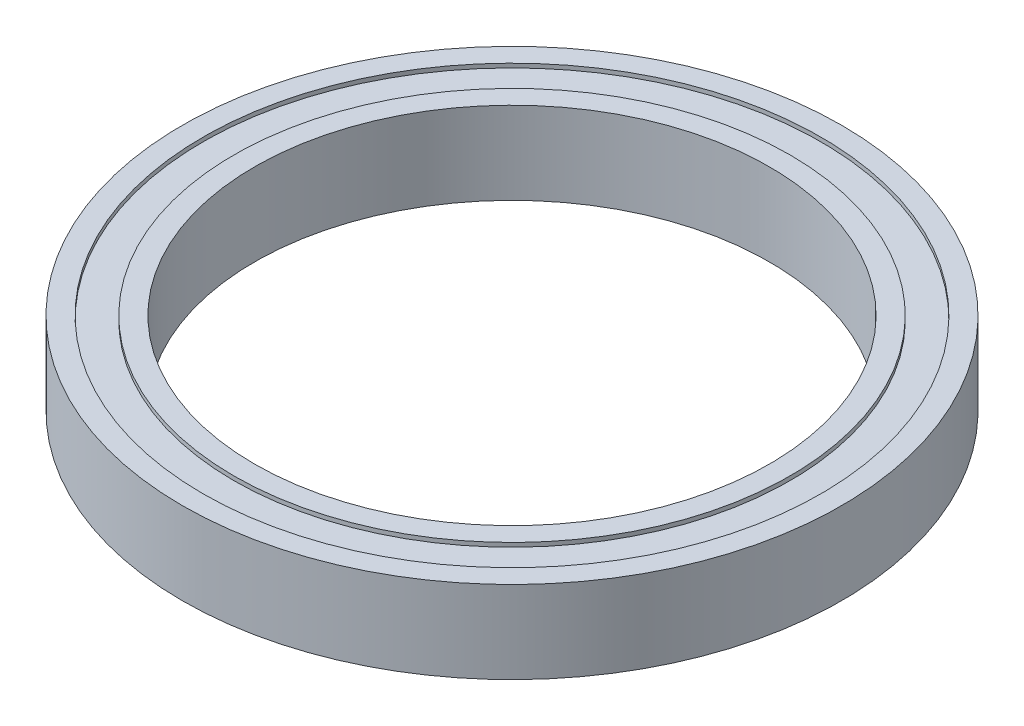
ISO-10303-21;
HEADER;
FILE_DESCRIPTION(('STEP AP214'),'2;1');
FILE_NAME('part.step','',(''),(''),'','','');
FILE_SCHEMA(('AUTOMOTIVE_DESIGN { 1 0 10303 214 1 1 1 1 }'));
ENDSEC;
DATA;
#1=APPLICATION_CONTEXT('core data for automotive mechanical design processes');
#2=APPLICATION_PROTOCOL_DEFINITION('international standard','automotive_design',2000,#1);
#3=PRODUCT_CONTEXT('',#1,'mechanical');
#4=PRODUCT('Part','Part','',(#3));
#5=PRODUCT_RELATED_PRODUCT_CATEGORY('part','',(#4));
#6=PRODUCT_DEFINITION_FORMATION('','',#4);
#7=PRODUCT_DEFINITION_CONTEXT('part definition',#1,'design');
#8=PRODUCT_DEFINITION('design','',#6,#7);
#9=PRODUCT_DEFINITION_SHAPE('','',#8);
#10=(LENGTH_UNIT() NAMED_UNIT(*) SI_UNIT(.MILLI.,.METRE.));
#11=(NAMED_UNIT(*) PLANE_ANGLE_UNIT() SI_UNIT($,.RADIAN.));
#12=(NAMED_UNIT(*) SI_UNIT($,.STERADIAN.) SOLID_ANGLE_UNIT());
#13=UNCERTAINTY_MEASURE_WITH_UNIT(LENGTH_MEASURE(1.E-05),#10,'distance_accuracy_value','');
#14=(GEOMETRIC_REPRESENTATION_CONTEXT(3) GLOBAL_UNCERTAINTY_ASSIGNED_CONTEXT((#13)) GLOBAL_UNIT_ASSIGNED_CONTEXT((#10,
#11,#12)) REPRESENTATION_CONTEXT('',''));
#15=CARTESIAN_POINT('',(0.,0.,0.));
#16=DIRECTION('',(0.,0.,1.));
#17=DIRECTION('',(1.,0.,0.));
#18=AXIS2_PLACEMENT_3D('',#15,#16,#17);
#19=CARTESIAN_POINT('',(0.,0.,0.));
#20=DIRECTION('',(0.,1.,0.));
#21=DIRECTION('',(0.,0.,1.));
#22=AXIS2_PLACEMENT_3D('',#19,#20,#21);
#23=PLANE('',#22);
#24=CARTESIAN_POINT('',(0.,0.,0.));
#25=DIRECTION('',(0.,1.,0.));
#26=DIRECTION('',(0.,0.,1.));
#27=AXIS2_PLACEMENT_3D('',#24,#25,#26);
#28=CIRCLE('',#27,12.5);
#29=CARTESIAN_POINT('',(0.,0.,12.5));
#30=VERTEX_POINT('',#29);
#31=EDGE_CURVE('E48',#30,#30,#28,.T.);
#32=ORIENTED_EDGE('',*,*,#31,.T.);
#33=EDGE_LOOP('',(#32));
#34=FACE_BOUND('',#33,.T.);
#35=CARTESIAN_POINT('',(0.,0.,0.));
#36=DIRECTION('',(0.,-1.,0.));
#37=DIRECTION('',(0.,0.,-1.));
#38=AXIS2_PLACEMENT_3D('',#35,#36,#37);
#39=CIRCLE('',#38,13.5);
#40=CARTESIAN_POINT('',(0.,0.,-13.5));
#41=VERTEX_POINT('',#40);
#42=EDGE_CURVE('E72',#41,#41,#39,.T.);
#43=ORIENTED_EDGE('',*,*,#42,.T.);
#44=EDGE_LOOP('',(#43));
#45=FACE_BOUND('',#44,.T.);
#46=ADVANCED_FACE('F35',(#34,#45),#23,.F.);
#47=CARTESIAN_POINT('',(0.,4.,0.));
#48=DIRECTION('',(0.,1.,0.));
#49=DIRECTION('',(0.,0.,1.));
#50=AXIS2_PLACEMENT_3D('',#47,#48,#49);
#51=PLANE('',#50);
#52=CARTESIAN_POINT('',(0.,4.,0.));
#53=DIRECTION('',(0.,1.,0.));
#54=DIRECTION('',(0.,0.,1.));
#55=AXIS2_PLACEMENT_3D('',#52,#53,#54);
#56=CIRCLE('',#55,12.5);
#57=CARTESIAN_POINT('',(0.,4.,12.5));
#58=VERTEX_POINT('',#57);
#59=EDGE_CURVE('E46',#58,#58,#56,.T.);
#60=ORIENTED_EDGE('',*,*,#59,.F.);
#61=EDGE_LOOP('',(#60));
#62=FACE_BOUND('',#61,.T.);
#63=CARTESIAN_POINT('',(0.,4.,0.));
#64=DIRECTION('',(0.,1.,0.));
#65=DIRECTION('',(0.,0.,1.));
#66=AXIS2_PLACEMENT_3D('',#63,#64,#65);
#67=CIRCLE('',#66,13.5);
#68=CARTESIAN_POINT('',(0.,4.,13.5));
#69=VERTEX_POINT('',#68);
#70=EDGE_CURVE('E60',#69,#69,#67,.T.);
#71=ORIENTED_EDGE('',*,*,#70,.T.);
#72=EDGE_LOOP('',(#71));
#73=FACE_BOUND('',#72,.T.);
#74=ADVANCED_FACE('F110',(#62,#73),#51,.T.);
#75=CARTESIAN_POINT('',(0.,4.,0.));
#76=DIRECTION('',(0.,1.,0.));
#77=DIRECTION('',(0.,0.,1.));
#78=AXIS2_PLACEMENT_3D('',#75,#76,#77);
#79=CIRCLE('',#78,15.);
#80=CARTESIAN_POINT('',(0.,4.,15.));
#81=VERTEX_POINT('',#80);
#82=EDGE_CURVE('E54',#81,#81,#79,.T.);
#83=ORIENTED_EDGE('',*,*,#82,.F.);
#84=EDGE_LOOP('',(#83));
#85=FACE_BOUND('',#84,.T.);
#86=CARTESIAN_POINT('',(0.,4.,0.));
#87=DIRECTION('',(0.,1.,0.));
#88=DIRECTION('',(0.,0.,1.));
#89=AXIS2_PLACEMENT_3D('',#86,#87,#88);
#90=CIRCLE('',#89,16.);
#91=CARTESIAN_POINT('',(0.,4.,16.));
#92=VERTEX_POINT('',#91);
#93=EDGE_CURVE('E10',#92,#92,#90,.T.);
#94=ORIENTED_EDGE('',*,*,#93,.T.);
#95=EDGE_LOOP('',(#94));
#96=FACE_BOUND('',#95,.T.);
#97=ADVANCED_FACE('F97',(#85,#96),#51,.T.);
#98=CARTESIAN_POINT('',(0.,0.,0.));
#99=DIRECTION('',(0.,-1.,0.));
#100=DIRECTION('',(0.,0.,-1.));
#101=AXIS2_PLACEMENT_3D('',#98,#99,#100);
#102=CIRCLE('',#101,15.);
#103=CARTESIAN_POINT('',(0.,0.,-15.));
#104=VERTEX_POINT('',#103);
#105=EDGE_CURVE('E66',#104,#104,#102,.T.);
#106=ORIENTED_EDGE('',*,*,#105,.F.);
#107=EDGE_LOOP('',(#106));
#108=FACE_BOUND('',#107,.T.);
#109=CARTESIAN_POINT('',(0.,0.,0.));
#110=DIRECTION('',(0.,1.,0.));
#111=DIRECTION('',(0.,0.,1.));
#112=AXIS2_PLACEMENT_3D('',#109,#110,#111);
#113=CIRCLE('',#112,16.);
#114=CARTESIAN_POINT('',(0.,0.,16.));
#115=VERTEX_POINT('',#114);
#116=EDGE_CURVE('E39',#115,#115,#113,.T.);
#117=ORIENTED_EDGE('',*,*,#116,.F.);
#118=EDGE_LOOP('',(#117));
#119=FACE_BOUND('',#118,.T.);
#120=ADVANCED_FACE('F94',(#108,#119),#23,.F.);
#121=CARTESIAN_POINT('',(0.,4.,0.));
#122=DIRECTION('',(0.,-1.,0.));
#123=DIRECTION('',(0.,0.,-1.));
#124=AXIS2_PLACEMENT_3D('',#121,#122,#123);
#125=CYLINDRICAL_SURFACE('',#124,16.);
#126=ORIENTED_EDGE('',*,*,#93,.F.);
#127=EDGE_LOOP('',(#126));
#128=FACE_BOUND('',#127,.T.);
#129=ORIENTED_EDGE('',*,*,#116,.T.);
#130=EDGE_LOOP('',(#129));
#131=FACE_BOUND('',#130,.T.);
#132=ADVANCED_FACE('F37',(#128,#131),#125,.T.);
#133=CARTESIAN_POINT('',(0.,4.,0.));
#134=DIRECTION('',(0.,-1.,0.));
#135=DIRECTION('',(0.,0.,-1.));
#136=AXIS2_PLACEMENT_3D('',#133,#134,#135);
#137=CYLINDRICAL_SURFACE('',#136,12.5);
#138=ORIENTED_EDGE('',*,*,#59,.T.);
#139=EDGE_LOOP('',(#138));
#140=FACE_BOUND('',#139,.T.);
#141=ORIENTED_EDGE('',*,*,#31,.F.);
#142=EDGE_LOOP('',(#141));
#143=FACE_BOUND('',#142,.T.);
#144=ADVANCED_FACE('F101',(#140,#143),#137,.F.);
#145=CARTESIAN_POINT('',(0.,3.8,0.));
#146=DIRECTION('',(0.,1.,0.));
#147=DIRECTION('',(0.,0.,1.));
#148=AXIS2_PLACEMENT_3D('',#145,#146,#147);
#149=CYLINDRICAL_SURFACE('',#148,15.);
#150=CARTESIAN_POINT('',(0.,3.8,0.));
#151=DIRECTION('',(0.,1.,0.));
#152=DIRECTION('',(0.,0.,1.));
#153=AXIS2_PLACEMENT_3D('',#150,#151,#152);
#154=CIRCLE('',#153,15.);
#155=CARTESIAN_POINT('',(0.,3.8,15.));
#156=VERTEX_POINT('',#155);
#157=EDGE_CURVE('E51',#156,#156,#154,.T.);
#158=ORIENTED_EDGE('',*,*,#157,.F.);
#159=EDGE_LOOP('',(#158));
#160=FACE_BOUND('',#159,.T.);
#161=ORIENTED_EDGE('',*,*,#82,.T.);
#162=EDGE_LOOP('',(#161));
#163=FACE_BOUND('',#162,.T.);
#164=ADVANCED_FACE('F106',(#160,#163),#149,.F.);
#165=CARTESIAN_POINT('',(0.,3.8,0.));
#166=DIRECTION('',(0.,1.,0.));
#167=DIRECTION('',(0.,0.,1.));
#168=AXIS2_PLACEMENT_3D('',#165,#166,#167);
#169=PLANE('',#168);
#170=CARTESIAN_POINT('',(0.,3.8,0.));
#171=DIRECTION('',(0.,1.,0.));
#172=DIRECTION('',(0.,0.,1.));
#173=AXIS2_PLACEMENT_3D('',#170,#171,#172);
#174=CIRCLE('',#173,13.5);
#175=CARTESIAN_POINT('',(0.,3.8,13.5));
#176=VERTEX_POINT('',#175);
#177=EDGE_CURVE('E57',#176,#176,#174,.T.);
#178=ORIENTED_EDGE('',*,*,#177,.F.);
#179=EDGE_LOOP('',(#178));
#180=FACE_BOUND('',#179,.T.);
#181=ORIENTED_EDGE('',*,*,#157,.T.);
#182=EDGE_LOOP('',(#181));
#183=FACE_BOUND('',#182,.T.);
#184=ADVANCED_FACE('F123',(#180,#183),#169,.T.);
#185=CARTESIAN_POINT('',(0.,3.8,0.));
#186=DIRECTION('',(0.,1.,0.));
#187=DIRECTION('',(0.,0.,1.));
#188=AXIS2_PLACEMENT_3D('',#185,#186,#187);
#189=CYLINDRICAL_SURFACE('',#188,13.5);
#190=ORIENTED_EDGE('',*,*,#177,.T.);
#191=EDGE_LOOP('',(#190));
#192=FACE_BOUND('',#191,.T.);
#193=ORIENTED_EDGE('',*,*,#70,.F.);
#194=EDGE_LOOP('',(#193));
#195=FACE_BOUND('',#194,.T.);
#196=ADVANCED_FACE('F90',(#192,#195),#189,.T.);
#197=CARTESIAN_POINT('',(0.,0.2,0.));
#198=DIRECTION('',(0.,-1.,0.));
#199=DIRECTION('',(0.,0.,-1.));
#200=AXIS2_PLACEMENT_3D('',#197,#198,#199);
#201=CYLINDRICAL_SURFACE('',#200,15.);
#202=CARTESIAN_POINT('',(0.,0.2,0.));
#203=DIRECTION('',(0.,-1.,0.));
#204=DIRECTION('',(0.,0.,-1.));
#205=AXIS2_PLACEMENT_3D('',#202,#203,#204);
#206=CIRCLE('',#205,15.);
#207=CARTESIAN_POINT('',(0.,0.2,-15.));
#208=VERTEX_POINT('',#207);
#209=EDGE_CURVE('E63',#208,#208,#206,.T.);
#210=ORIENTED_EDGE('',*,*,#209,.F.);
#211=EDGE_LOOP('',(#210));
#212=FACE_BOUND('',#211,.T.);
#213=ORIENTED_EDGE('',*,*,#105,.T.);
#214=EDGE_LOOP('',(#213));
#215=FACE_BOUND('',#214,.T.);
#216=ADVANCED_FACE('F84',(#212,#215),#201,.F.);
#217=CARTESIAN_POINT('',(0.,0.2,0.));
#218=DIRECTION('',(0.,-1.,0.));
#219=DIRECTION('',(0.,0.,-1.));
#220=AXIS2_PLACEMENT_3D('',#217,#218,#219);
#221=PLANE('',#220);
#222=CARTESIAN_POINT('',(0.,0.2,0.));
#223=DIRECTION('',(0.,-1.,0.));
#224=DIRECTION('',(0.,0.,-1.));
#225=AXIS2_PLACEMENT_3D('',#222,#223,#224);
#226=CIRCLE('',#225,13.5);
#227=CARTESIAN_POINT('',(0.,0.2,-13.5));
#228=VERTEX_POINT('',#227);
#229=EDGE_CURVE('E69',#228,#228,#226,.T.);
#230=ORIENTED_EDGE('',*,*,#229,.F.);
#231=EDGE_LOOP('',(#230));
#232=FACE_BOUND('',#231,.T.);
#233=ORIENTED_EDGE('',*,*,#209,.T.);
#234=EDGE_LOOP('',(#233));
#235=FACE_BOUND('',#234,.T.);
#236=ADVANCED_FACE('F81',(#232,#235),#221,.T.);
#237=CARTESIAN_POINT('',(0.,0.2,0.));
#238=DIRECTION('',(0.,-1.,0.));
#239=DIRECTION('',(0.,0.,-1.));
#240=AXIS2_PLACEMENT_3D('',#237,#238,#239);
#241=CYLINDRICAL_SURFACE('',#240,13.5);
#242=ORIENTED_EDGE('',*,*,#229,.T.);
#243=EDGE_LOOP('',(#242));
#244=FACE_BOUND('',#243,.T.);
#245=ORIENTED_EDGE('',*,*,#42,.F.);
#246=EDGE_LOOP('',(#245));
#247=FACE_BOUND('',#246,.T.);
#248=ADVANCED_FACE('F78',(#244,#247),#241,.T.);
#249=CLOSED_SHELL('',(#46,#74,#97,#120,#132,#144,#164,#184,#196,#216,#236,#248));
#250=MANIFOLD_SOLID_BREP('B2',#249);
#251=ADVANCED_BREP_SHAPE_REPRESENTATION('',(#18,#250),#14);
#252=SHAPE_DEFINITION_REPRESENTATION(#9,#251);
ENDSEC;
END-ISO-10303-21;
